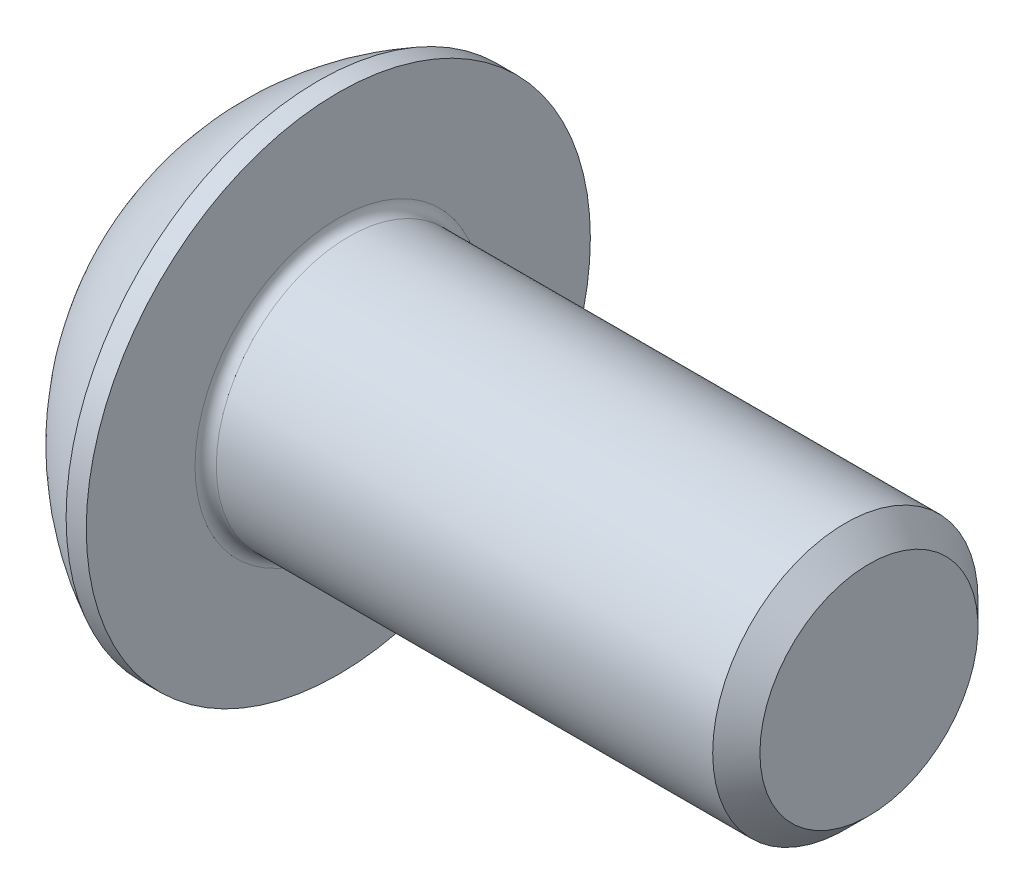
ISO-10303-21;
HEADER;
FILE_DESCRIPTION(('STEP AP214'),'2;1');
FILE_NAME('part.step','',(''),(''),'','','');
FILE_SCHEMA(('AUTOMOTIVE_DESIGN { 1 0 10303 214 1 1 1 1 }'));
ENDSEC;
DATA;
#1=APPLICATION_CONTEXT('core data for automotive mechanical design processes');
#2=APPLICATION_PROTOCOL_DEFINITION('international standard','automotive_design',2000,#1);
#3=PRODUCT_CONTEXT('',#1,'mechanical');
#4=PRODUCT('Part','Part','',(#3));
#5=PRODUCT_RELATED_PRODUCT_CATEGORY('part','',(#4));
#6=PRODUCT_DEFINITION_FORMATION('','',#4);
#7=PRODUCT_DEFINITION_CONTEXT('part definition',#1,'design');
#8=PRODUCT_DEFINITION('design','',#6,#7);
#9=PRODUCT_DEFINITION_SHAPE('','',#8);
#10=(LENGTH_UNIT() NAMED_UNIT(*) SI_UNIT(.MILLI.,.METRE.));
#11=(NAMED_UNIT(*) PLANE_ANGLE_UNIT() SI_UNIT($,.RADIAN.));
#12=(NAMED_UNIT(*) SI_UNIT($,.STERADIAN.) SOLID_ANGLE_UNIT());
#13=UNCERTAINTY_MEASURE_WITH_UNIT(LENGTH_MEASURE(1.E-05),#10,'distance_accuracy_value','');
#14=(GEOMETRIC_REPRESENTATION_CONTEXT(3) GLOBAL_UNCERTAINTY_ASSIGNED_CONTEXT((#13)) GLOBAL_UNIT_ASSIGNED_CONTEXT((#10,
#11,#12)) REPRESENTATION_CONTEXT('',''));
#15=CARTESIAN_POINT('',(0.,0.,0.));
#16=DIRECTION('',(0.,0.,1.));
#17=DIRECTION('',(1.,0.,0.));
#18=AXIS2_PLACEMENT_3D('',#15,#16,#17);
#19=CARTESIAN_POINT('',(0.,0.,0.));
#20=DIRECTION('',(-1.,0.,0.));
#21=DIRECTION('',(0.,0.,1.));
#22=AXIS2_PLACEMENT_3D('',#19,#20,#21);
#23=PLANE('',#22);
#24=CARTESIAN_POINT('',(0.,0.,0.));
#25=DIRECTION('',(-1.,0.,0.));
#26=DIRECTION('',(0.,0.,1.));
#27=AXIS2_PLACEMENT_3D('',#24,#25,#26);
#28=CIRCLE('',#27,2.375);
#29=CARTESIAN_POINT('',(0.,0.,2.375));
#30=VERTEX_POINT('',#29);
#31=EDGE_CURVE('E154',#30,#30,#28,.T.);
#32=ORIENTED_EDGE('',*,*,#31,.T.);
#33=EDGE_LOOP('',(#32));
#34=FACE_BOUND('',#33,.T.);
#35=DIRECTION('',(0.,-1.,0.));
#36=VECTOR('',#35,1.);
#37=CARTESIAN_POINT('',(0.,-0.866025403784438,1.5));
#38=LINE('',#37,#36);
#39=CARTESIAN_POINT('',(0.,0.866025403784439,1.5));
#40=VERTEX_POINT('',#39);
#41=CARTESIAN_POINT('',(0.,-0.866025403784438,1.5));
#42=VERTEX_POINT('',#41);
#43=EDGE_CURVE('E49',#40,#42,#38,.T.);
#44=ORIENTED_EDGE('',*,*,#43,.T.);
#45=DIRECTION('',(0.,-0.500000000000001,-0.866025403784438));
#46=VECTOR('',#45,1.);
#47=CARTESIAN_POINT('',(0.,-1.73205080756888,0.));
#48=LINE('',#47,#46);
#49=CARTESIAN_POINT('',(0.,-1.73205080756888,0.));
#50=VERTEX_POINT('',#49);
#51=EDGE_CURVE('E274',#42,#50,#48,.T.);
#52=ORIENTED_EDGE('',*,*,#51,.T.);
#53=DIRECTION('',(0.,0.500000000000001,-0.866025403784438));
#54=VECTOR('',#53,1.);
#55=CARTESIAN_POINT('',(0.,-0.866025403784438,-1.5));
#56=LINE('',#55,#54);
#57=CARTESIAN_POINT('',(0.,-0.866025403784438,-1.5));
#58=VERTEX_POINT('',#57);
#59=EDGE_CURVE('E129',#50,#58,#56,.T.);
#60=ORIENTED_EDGE('',*,*,#59,.T.);
#61=DIRECTION('',(0.,1.,0.));
#62=VECTOR('',#61,1.);
#63=CARTESIAN_POINT('',(0.,0.866025403784439,-1.5));
#64=LINE('',#63,#62);
#65=CARTESIAN_POINT('',(0.,0.866025403784439,-1.5));
#66=VERTEX_POINT('',#65);
#67=EDGE_CURVE('E277',#58,#66,#64,.T.);
#68=ORIENTED_EDGE('',*,*,#67,.T.);
#69=DIRECTION('',(0.,0.5,0.866025403784439));
#70=VECTOR('',#69,1.);
#71=CARTESIAN_POINT('',(0.,1.73205080756888,0.));
#72=LINE('',#71,#70);
#73=CARTESIAN_POINT('',(0.,1.73205080756888,0.));
#74=VERTEX_POINT('',#73);
#75=EDGE_CURVE('E279',#66,#74,#72,.T.);
#76=ORIENTED_EDGE('',*,*,#75,.T.);
#77=DIRECTION('',(0.,-0.5,0.866025403784439));
#78=VECTOR('',#77,1.);
#79=CARTESIAN_POINT('',(0.,0.866025403784439,1.5));
#80=LINE('',#79,#78);
#81=EDGE_CURVE('E281',#74,#40,#80,.T.);
#82=ORIENTED_EDGE('',*,*,#81,.T.);
#83=EDGE_LOOP('',(#44,#52,#60,#68,#76,#82));
#84=FACE_BOUND('',#83,.T.);
#85=ADVANCED_FACE('F34',(#34,#84),#23,.T.);
#86=CARTESIAN_POINT('',(4.75501582278481,0.,0.));
#87=DIRECTION('',(-1.,0.,0.));
#88=DIRECTION('',(0.,1.,0.));
#89=AXIS2_PLACEMENT_3D('',#86,#87,#88);
#90=SPHERICAL_SURFACE('',#89,5.3151482081814);
#91=CARTESIAN_POINT('',(2.37,0.,0.));
#92=DIRECTION('',(-1.,0.,0.));
#93=DIRECTION('',(0.,0.,1.));
#94=AXIS2_PLACEMENT_3D('',#91,#92,#93);
#95=CIRCLE('',#94,4.75);
#96=CARTESIAN_POINT('',(2.37,0.,4.75));
#97=VERTEX_POINT('',#96);
#98=EDGE_CURVE('E151',#97,#97,#95,.T.);
#99=ORIENTED_EDGE('',*,*,#98,.T.);
#100=EDGE_LOOP('',(#99));
#101=FACE_BOUND('',#100,.T.);
#102=ORIENTED_EDGE('',*,*,#31,.F.);
#103=EDGE_LOOP('',(#102));
#104=FACE_BOUND('',#103,.T.);
#105=ADVANCED_FACE('F175',(#101,#104),#90,.T.);
#106=CARTESIAN_POINT('',(0.,0.,0.));
#107=DIRECTION('',(-1.,0.,0.));
#108=DIRECTION('',(0.,0.,1.));
#109=AXIS2_PLACEMENT_3D('',#106,#107,#108);
#110=CYLINDRICAL_SURFACE('',#109,4.75);
#111=ORIENTED_EDGE('',*,*,#98,.F.);
#112=EDGE_LOOP('',(#111));
#113=FACE_BOUND('',#112,.T.);
#114=CARTESIAN_POINT('',(2.75,0.,0.));
#115=DIRECTION('',(-1.,0.,0.));
#116=DIRECTION('',(0.,0.,1.));
#117=AXIS2_PLACEMENT_3D('',#114,#115,#116);
#118=CIRCLE('',#117,4.75);
#119=CARTESIAN_POINT('',(2.75,0.,4.75));
#120=VERTEX_POINT('',#119);
#121=EDGE_CURVE('E148',#120,#120,#118,.T.);
#122=ORIENTED_EDGE('',*,*,#121,.T.);
#123=EDGE_LOOP('',(#122));
#124=FACE_BOUND('',#123,.T.);
#125=ADVANCED_FACE('F180',(#113,#124),#110,.T.);
#126=CARTESIAN_POINT('',(2.75,2.5,0.));
#127=DIRECTION('',(-1.,0.,0.));
#128=DIRECTION('',(0.,0.,1.));
#129=AXIS2_PLACEMENT_3D('',#126,#127,#128);
#130=PLANE('',#129);
#131=CARTESIAN_POINT('',(2.75,0.,0.));
#132=DIRECTION('',(-1.,0.,0.));
#133=DIRECTION('',(0.,0.,1.));
#134=AXIS2_PLACEMENT_3D('',#131,#132,#133);
#135=CIRCLE('',#134,2.7);
#136=CARTESIAN_POINT('',(2.75,0.,2.7));
#137=VERTEX_POINT('',#136);
#138=EDGE_CURVE('E42',#137,#137,#135,.T.);
#139=ORIENTED_EDGE('',*,*,#138,.T.);
#140=EDGE_LOOP('',(#139));
#141=FACE_BOUND('',#140,.T.);
#142=ORIENTED_EDGE('',*,*,#121,.F.);
#143=EDGE_LOOP('',(#142));
#144=FACE_BOUND('',#143,.T.);
#145=ADVANCED_FACE('F159',(#141,#144),#130,.F.);
#146=CARTESIAN_POINT('',(0.,0.,0.));
#147=DIRECTION('',(-1.,0.,0.));
#148=DIRECTION('',(0.,0.,1.));
#149=AXIS2_PLACEMENT_3D('',#146,#147,#148);
#150=CYLINDRICAL_SURFACE('',#149,2.5);
#151=CARTESIAN_POINT('',(2.95,0.,0.));
#152=DIRECTION('',(-1.,0.,0.));
#153=DIRECTION('',(0.,0.,1.));
#154=AXIS2_PLACEMENT_3D('',#151,#152,#153);
#155=CIRCLE('',#154,2.5);
#156=CARTESIAN_POINT('',(2.95,0.,2.5));
#157=VERTEX_POINT('',#156);
#158=EDGE_CURVE('E11',#157,#157,#155,.F.);
#159=ORIENTED_EDGE('',*,*,#158,.T.);
#160=EDGE_LOOP('',(#159));
#161=FACE_BOUND('',#160,.T.);
#162=CARTESIAN_POINT('',(12.305,0.,0.));
#163=DIRECTION('',(-1.,0.,0.));
#164=DIRECTION('',(0.,0.,1.));
#165=AXIS2_PLACEMENT_3D('',#162,#163,#164);
#166=CIRCLE('',#165,2.5);
#167=CARTESIAN_POINT('',(12.305,0.,2.5));
#168=VERTEX_POINT('',#167);
#169=EDGE_CURVE('E145',#168,#168,#166,.T.);
#170=ORIENTED_EDGE('',*,*,#169,.T.);
#171=EDGE_LOOP('',(#170));
#172=FACE_BOUND('',#171,.T.);
#173=ADVANCED_FACE('F189',(#161,#172),#150,.T.);
#174=CARTESIAN_POINT('',(12.75,0.,0.));
#175=DIRECTION('',(-1.,0.,0.));
#176=DIRECTION('',(0.,0.,1.));
#177=AXIS2_PLACEMENT_3D('',#174,#175,#176);
#178=CONICAL_SURFACE('',#177,2.055,0.785398163397441);
#179=ORIENTED_EDGE('',*,*,#169,.F.);
#180=EDGE_LOOP('',(#179));
#181=FACE_BOUND('',#180,.T.);
#182=CARTESIAN_POINT('',(12.75,0.,0.));
#183=DIRECTION('',(-1.,0.,0.));
#184=DIRECTION('',(0.,0.,1.));
#185=AXIS2_PLACEMENT_3D('',#182,#183,#184);
#186=CIRCLE('',#185,2.055);
#187=CARTESIAN_POINT('',(12.75,0.,2.055));
#188=VERTEX_POINT('',#187);
#189=EDGE_CURVE('E141',#188,#188,#186,.T.);
#190=ORIENTED_EDGE('',*,*,#189,.T.);
#191=EDGE_LOOP('',(#190));
#192=FACE_BOUND('',#191,.T.);
#193=ADVANCED_FACE('F170',(#181,#192),#178,.T.);
#194=CARTESIAN_POINT('',(12.75,0.,0.));
#195=DIRECTION('',(-1.,0.,0.));
#196=DIRECTION('',(0.,0.,1.));
#197=AXIS2_PLACEMENT_3D('',#194,#195,#196);
#198=PLANE('',#197);
#199=ORIENTED_EDGE('',*,*,#189,.F.);
#200=EDGE_LOOP('',(#199));
#201=FACE_BOUND('',#200,.T.);
#202=ADVANCED_FACE('F163',(#201),#198,.F.);
#203=CARTESIAN_POINT('',(2.95,0.,0.));
#204=DIRECTION('',(-1.,0.,0.));
#205=DIRECTION('',(0.,0.,1.));
#206=AXIS2_PLACEMENT_3D('',#203,#204,#205);
#207=TOROIDAL_SURFACE('',#206,2.7,0.2);
#208=ORIENTED_EDGE('',*,*,#158,.F.);
#209=EDGE_LOOP('',(#208));
#210=FACE_BOUND('',#209,.T.);
#211=ORIENTED_EDGE('',*,*,#138,.F.);
#212=EDGE_LOOP('',(#211));
#213=FACE_BOUND('',#212,.T.);
#214=ADVANCED_FACE('F36',(#210,#213),#207,.F.);
#215=CARTESIAN_POINT('',(1.56,-1.73205080756888,0.));
#216=DIRECTION('',(0.,0.866025403784438,-0.500000000000001));
#217=DIRECTION('',(0.,0.500000000000001,0.866025403784438));
#218=AXIS2_PLACEMENT_3D('',#215,#216,#217);
#219=PLANE('',#218);
#220=DIRECTION('',(0.,-0.500000000000001,-0.866025403784438));
#221=VECTOR('',#220,1.);
#222=CARTESIAN_POINT('',(1.56,-1.73205080756888,0.));
#223=LINE('',#222,#221);
#224=CARTESIAN_POINT('',(1.56,-0.866025403784438,1.5));
#225=VERTEX_POINT('',#224);
#226=CARTESIAN_POINT('',(1.56,-1.29903810567666,0.750000000000002));
#227=VERTEX_POINT('',#226);
#228=EDGE_CURVE('E115',#225,#227,#223,.T.);
#229=ORIENTED_EDGE('',*,*,#228,.T.);
#230=CARTESIAN_POINT('',(1.56,-1.73205080756888,0.));
#231=VERTEX_POINT('',#230);
#232=EDGE_CURVE('E110',#227,#231,#223,.T.);
#233=ORIENTED_EDGE('',*,*,#232,.T.);
#234=DIRECTION('',(-1.,0.,0.));
#235=VECTOR('',#234,1.);
#236=CARTESIAN_POINT('',(1.56,-1.73205080756888,0.));
#237=LINE('',#236,#235);
#238=EDGE_CURVE('E112',#231,#50,#237,.T.);
#239=ORIENTED_EDGE('',*,*,#238,.T.);
#240=ORIENTED_EDGE('',*,*,#51,.F.);
#241=DIRECTION('',(-1.,0.,0.));
#242=VECTOR('',#241,1.);
#243=CARTESIAN_POINT('',(1.56,-0.866025403784438,1.5));
#244=LINE('',#243,#242);
#245=EDGE_CURVE('E270',#225,#42,#244,.T.);
#246=ORIENTED_EDGE('',*,*,#245,.F.);
#247=EDGE_LOOP('',(#229,#233,#239,#240,#246));
#248=FACE_BOUND('',#247,.T.);
#249=ADVANCED_FACE('F111',(#248),#219,.T.);
#250=CARTESIAN_POINT('',(1.56,-0.866025403784438,-1.5));
#251=DIRECTION('',(0.,0.866025403784438,0.500000000000001));
#252=DIRECTION('',(0.,-0.500000000000001,0.866025403784438));
#253=AXIS2_PLACEMENT_3D('',#250,#251,#252);
#254=PLANE('',#253);
#255=DIRECTION('',(0.,0.500000000000001,-0.866025403784438));
#256=VECTOR('',#255,1.);
#257=CARTESIAN_POINT('',(1.56,-0.866025403784438,-1.5));
#258=LINE('',#257,#256);
#259=CARTESIAN_POINT('',(1.56,-1.29903810567666,-0.750000000000001));
#260=VERTEX_POINT('',#259);
#261=EDGE_CURVE('E57',#231,#260,#258,.T.);
#262=ORIENTED_EDGE('',*,*,#261,.T.);
#263=CARTESIAN_POINT('',(1.56,-0.866025403784438,-1.5));
#264=VERTEX_POINT('',#263);
#265=EDGE_CURVE('E124',#260,#264,#258,.T.);
#266=ORIENTED_EDGE('',*,*,#265,.T.);
#267=DIRECTION('',(-1.,0.,0.));
#268=VECTOR('',#267,1.);
#269=CARTESIAN_POINT('',(1.56,-0.866025403784438,-1.5));
#270=LINE('',#269,#268);
#271=EDGE_CURVE('E131',#264,#58,#270,.T.);
#272=ORIENTED_EDGE('',*,*,#271,.T.);
#273=ORIENTED_EDGE('',*,*,#59,.F.);
#274=ORIENTED_EDGE('',*,*,#238,.F.);
#275=EDGE_LOOP('',(#262,#266,#272,#273,#274));
#276=FACE_BOUND('',#275,.T.);
#277=ADVANCED_FACE('F127',(#276),#254,.T.);
#278=CARTESIAN_POINT('',(1.56,0.866025403784439,-1.5));
#279=DIRECTION('',(0.,0.,1.));
#280=DIRECTION('',(1.,0.,0.));
#281=AXIS2_PLACEMENT_3D('',#278,#279,#280);
#282=PLANE('',#281);
#283=DIRECTION('',(0.,1.,0.));
#284=VECTOR('',#283,1.);
#285=CARTESIAN_POINT('',(1.56,0.866025403784439,-1.5));
#286=LINE('',#285,#284);
#287=CARTESIAN_POINT('',(1.56,0.,-1.5));
#288=VERTEX_POINT('',#287);
#289=EDGE_CURVE('E251',#264,#288,#286,.T.);
#290=ORIENTED_EDGE('',*,*,#289,.T.);
#291=CARTESIAN_POINT('',(1.56,0.866025403784439,-1.5));
#292=VERTEX_POINT('',#291);
#293=EDGE_CURVE('E123',#288,#292,#286,.T.);
#294=ORIENTED_EDGE('',*,*,#293,.T.);
#295=DIRECTION('',(-1.,0.,0.));
#296=VECTOR('',#295,1.);
#297=CARTESIAN_POINT('',(1.56,0.866025403784439,-1.5));
#298=LINE('',#297,#296);
#299=EDGE_CURVE('E136',#292,#66,#298,.T.);
#300=ORIENTED_EDGE('',*,*,#299,.T.);
#301=ORIENTED_EDGE('',*,*,#67,.F.);
#302=ORIENTED_EDGE('',*,*,#271,.F.);
#303=EDGE_LOOP('',(#290,#294,#300,#301,#302));
#304=FACE_BOUND('',#303,.T.);
#305=ADVANCED_FACE('F203',(#304),#282,.T.);
#306=CARTESIAN_POINT('',(1.56,1.73205080756888,0.));
#307=DIRECTION('',(0.,-0.866025403784439,0.5));
#308=DIRECTION('',(0.,-0.5,-0.866025403784439));
#309=AXIS2_PLACEMENT_3D('',#306,#307,#308);
#310=PLANE('',#309);
#311=DIRECTION('',(0.,0.5,0.866025403784439));
#312=VECTOR('',#311,1.);
#313=CARTESIAN_POINT('',(1.56,1.73205080756888,0.));
#314=LINE('',#313,#312);
#315=CARTESIAN_POINT('',(1.56,1.29903810567666,-0.75));
#316=VERTEX_POINT('',#315);
#317=EDGE_CURVE('E240',#292,#316,#314,.T.);
#318=ORIENTED_EDGE('',*,*,#317,.T.);
#319=CARTESIAN_POINT('',(1.56,1.73205080756888,0.));
#320=VERTEX_POINT('',#319);
#321=EDGE_CURVE('E245',#316,#320,#314,.T.);
#322=ORIENTED_EDGE('',*,*,#321,.T.);
#323=DIRECTION('',(-1.,0.,0.));
#324=VECTOR('',#323,1.);
#325=CARTESIAN_POINT('',(1.56,1.73205080756888,0.));
#326=LINE('',#325,#324);
#327=EDGE_CURVE('E285',#320,#74,#326,.T.);
#328=ORIENTED_EDGE('',*,*,#327,.T.);
#329=ORIENTED_EDGE('',*,*,#75,.F.);
#330=ORIENTED_EDGE('',*,*,#299,.F.);
#331=EDGE_LOOP('',(#318,#322,#328,#329,#330));
#332=FACE_BOUND('',#331,.T.);
#333=ADVANCED_FACE('F206',(#332),#310,.T.);
#334=CARTESIAN_POINT('',(1.56,0.866025403784439,1.5));
#335=DIRECTION('',(0.,-0.866025403784439,-0.5));
#336=DIRECTION('',(0.,0.5,-0.866025403784439));
#337=AXIS2_PLACEMENT_3D('',#334,#335,#336);
#338=PLANE('',#337);
#339=DIRECTION('',(0.,-0.5,0.866025403784439));
#340=VECTOR('',#339,1.);
#341=CARTESIAN_POINT('',(1.56,0.866025403784439,1.5));
#342=LINE('',#341,#340);
#343=CARTESIAN_POINT('',(1.56,1.29903810567666,0.75));
#344=VERTEX_POINT('',#343);
#345=EDGE_CURVE('E248',#320,#344,#342,.T.);
#346=ORIENTED_EDGE('',*,*,#345,.T.);
#347=CARTESIAN_POINT('',(1.56,0.866025403784439,1.5));
#348=VERTEX_POINT('',#347);
#349=EDGE_CURVE('E256',#344,#348,#342,.T.);
#350=ORIENTED_EDGE('',*,*,#349,.T.);
#351=DIRECTION('',(-1.,0.,0.));
#352=VECTOR('',#351,1.);
#353=CARTESIAN_POINT('',(1.56,0.866025403784439,1.5));
#354=LINE('',#353,#352);
#355=EDGE_CURVE('E269',#348,#40,#354,.T.);
#356=ORIENTED_EDGE('',*,*,#355,.T.);
#357=ORIENTED_EDGE('',*,*,#81,.F.);
#358=ORIENTED_EDGE('',*,*,#327,.F.);
#359=EDGE_LOOP('',(#346,#350,#356,#357,#358));
#360=FACE_BOUND('',#359,.T.);
#361=ADVANCED_FACE('F210',(#360),#338,.T.);
#362=CARTESIAN_POINT('',(1.56,-0.866025403784438,1.5));
#363=DIRECTION('',(0.,0.,-1.));
#364=DIRECTION('',(-1.,0.,0.));
#365=AXIS2_PLACEMENT_3D('',#362,#363,#364);
#366=PLANE('',#365);
#367=DIRECTION('',(0.,-1.,0.));
#368=VECTOR('',#367,1.);
#369=CARTESIAN_POINT('',(1.56,-0.866025403784438,1.5));
#370=LINE('',#369,#368);
#371=CARTESIAN_POINT('',(1.56,0.,1.5));
#372=VERTEX_POINT('',#371);
#373=EDGE_CURVE('E262',#348,#372,#370,.T.);
#374=ORIENTED_EDGE('',*,*,#373,.T.);
#375=EDGE_CURVE('E264',#372,#225,#370,.T.);
#376=ORIENTED_EDGE('',*,*,#375,.T.);
#377=ORIENTED_EDGE('',*,*,#245,.T.);
#378=ORIENTED_EDGE('',*,*,#43,.F.);
#379=ORIENTED_EDGE('',*,*,#355,.F.);
#380=EDGE_LOOP('',(#374,#376,#377,#378,#379));
#381=FACE_BOUND('',#380,.T.);
#382=ADVANCED_FACE('F214',(#381),#366,.T.);
#383=CARTESIAN_POINT('',(1.56,-1.73205080756888,0.));
#384=DIRECTION('',(1.,0.,0.));
#385=DIRECTION('',(0.,0.,-1.));
#386=AXIS2_PLACEMENT_3D('',#383,#384,#385);
#387=PLANE('',#386);
#388=CARTESIAN_POINT('',(1.56,0.,0.));
#389=DIRECTION('',(-1.,0.,0.));
#390=DIRECTION('',(0.,0.,1.));
#391=AXIS2_PLACEMENT_3D('',#388,#389,#390);
#392=CIRCLE('',#391,1.5);
#393=EDGE_CURVE('E237',#316,#288,#392,.T.);
#394=ORIENTED_EDGE('',*,*,#393,.F.);
#395=ORIENTED_EDGE('',*,*,#317,.F.);
#396=ORIENTED_EDGE('',*,*,#293,.F.);
#397=EDGE_LOOP('',(#394,#395,#396));
#398=FACE_BOUND('',#397,.T.);
#399=ADVANCED_FACE('F218',(#398),#387,.F.);
#400=EDGE_CURVE('E142',#344,#316,#392,.T.);
#401=ORIENTED_EDGE('',*,*,#400,.F.);
#402=ORIENTED_EDGE('',*,*,#345,.F.);
#403=ORIENTED_EDGE('',*,*,#321,.F.);
#404=EDGE_LOOP('',(#401,#402,#403));
#405=FACE_BOUND('',#404,.T.);
#406=ADVANCED_FACE('F227',(#405),#387,.F.);
#407=EDGE_CURVE('E135',#372,#344,#392,.T.);
#408=ORIENTED_EDGE('',*,*,#407,.F.);
#409=ORIENTED_EDGE('',*,*,#373,.F.);
#410=ORIENTED_EDGE('',*,*,#349,.F.);
#411=EDGE_LOOP('',(#408,#409,#410));
#412=FACE_BOUND('',#411,.T.);
#413=ADVANCED_FACE('F232',(#412),#387,.F.);
#414=EDGE_CURVE('E130',#227,#372,#392,.T.);
#415=ORIENTED_EDGE('',*,*,#414,.F.);
#416=ORIENTED_EDGE('',*,*,#228,.F.);
#417=ORIENTED_EDGE('',*,*,#375,.F.);
#418=EDGE_LOOP('',(#415,#416,#417));
#419=FACE_BOUND('',#418,.T.);
#420=ADVANCED_FACE('F225',(#419),#387,.F.);
#421=EDGE_CURVE('E121',#260,#227,#392,.T.);
#422=ORIENTED_EDGE('',*,*,#421,.F.);
#423=ORIENTED_EDGE('',*,*,#261,.F.);
#424=ORIENTED_EDGE('',*,*,#232,.F.);
#425=EDGE_LOOP('',(#422,#423,#424));
#426=FACE_BOUND('',#425,.T.);
#427=ADVANCED_FACE('F120',(#426),#387,.F.);
#428=EDGE_CURVE('E243',#288,#260,#392,.T.);
#429=ORIENTED_EDGE('',*,*,#428,.F.);
#430=ORIENTED_EDGE('',*,*,#289,.F.);
#431=ORIENTED_EDGE('',*,*,#265,.F.);
#432=EDGE_LOOP('',(#429,#430,#431));
#433=FACE_BOUND('',#432,.T.);
#434=ADVANCED_FACE('F198',(#433),#387,.F.);
#435=CARTESIAN_POINT('',(2.42602540378445,0.,0.));
#436=DIRECTION('',(-1.,0.,0.));
#437=DIRECTION('',(0.,0.,1.));
#438=AXIS2_PLACEMENT_3D('',#435,#436,#437);
#439=CONICAL_SURFACE('',#438,0.,1.04719755119659);
#440=ORIENTED_EDGE('',*,*,#407,.T.);
#441=ORIENTED_EDGE('',*,*,#400,.T.);
#442=ORIENTED_EDGE('',*,*,#393,.T.);
#443=ORIENTED_EDGE('',*,*,#428,.T.);
#444=ORIENTED_EDGE('',*,*,#421,.T.);
#445=ORIENTED_EDGE('',*,*,#414,.T.);
#446=EDGE_LOOP('',(#440,#441,#442,#443,#444,#445));
#447=FACE_BOUND('',#446,.T.);
#448=CARTESIAN_POINT('',(2.42602540378445,0.,0.));
#449=VERTEX_POINT('',#448);
#450=VERTEX_LOOP('',#449);
#451=FACE_BOUND('',#450,.T.);
#452=ADVANCED_FACE('F196',(#447,#451),#439,.F.);
#453=CLOSED_SHELL('',(#85,#105,#125,#145,#173,#193,#202,#214,#249,#277,#305,#333,#361,#382,#399,
#406,#413,#420,#427,#434,#452));
#454=MANIFOLD_SOLID_BREP('B2',#453);
#455=ADVANCED_BREP_SHAPE_REPRESENTATION('',(#18,#454),#14);
#456=SHAPE_DEFINITION_REPRESENTATION(#9,#455);
ENDSEC;
END-ISO-10303-21;
